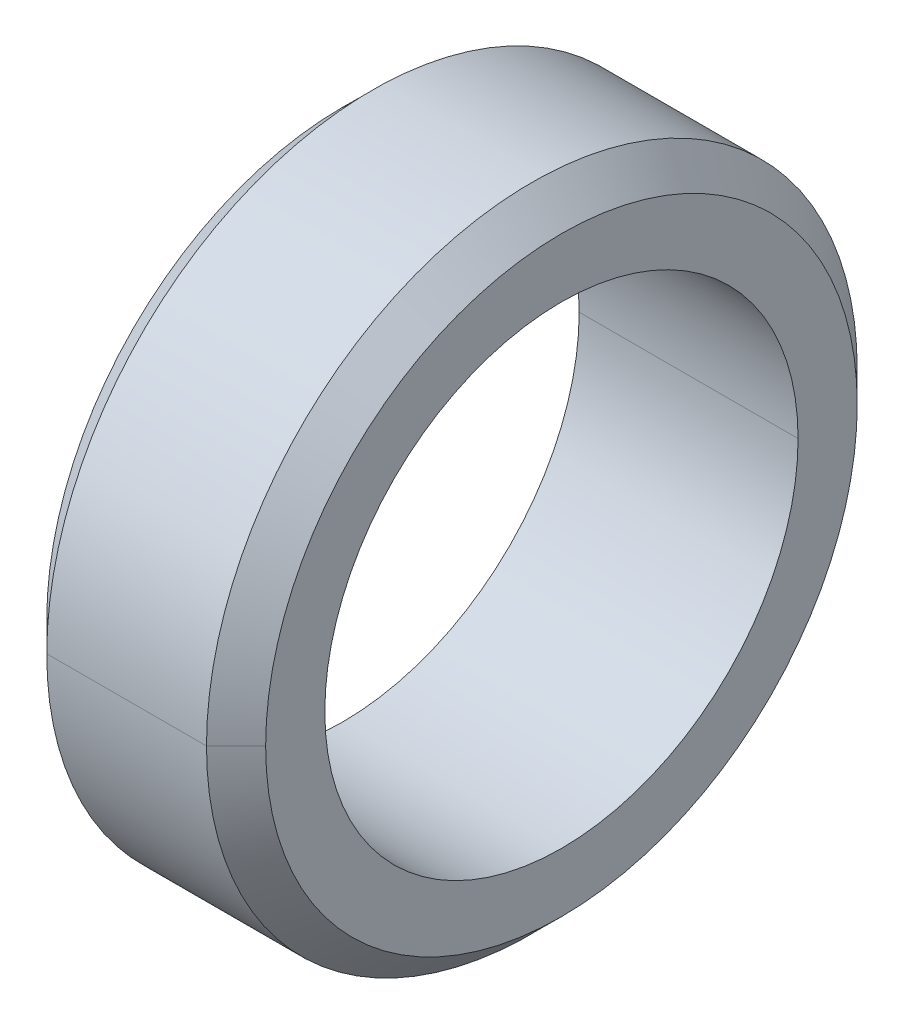
ISO-10303-21;
HEADER;
FILE_DESCRIPTION(('STEP AP214'),'2;1');
FILE_NAME('part.step','',(''),(''),'','','');
FILE_SCHEMA(('AUTOMOTIVE_DESIGN { 1 0 10303 214 1 1 1 1 }'));
ENDSEC;
DATA;
#1=APPLICATION_CONTEXT('core data for automotive mechanical design processes');
#2=APPLICATION_PROTOCOL_DEFINITION('international standard','automotive_design',2000,#1);
#3=PRODUCT_CONTEXT('',#1,'mechanical');
#4=PRODUCT('Part','Part','',(#3));
#5=PRODUCT_RELATED_PRODUCT_CATEGORY('part','',(#4));
#6=PRODUCT_DEFINITION_FORMATION('','',#4);
#7=PRODUCT_DEFINITION_CONTEXT('part definition',#1,'design');
#8=PRODUCT_DEFINITION('design','',#6,#7);
#9=PRODUCT_DEFINITION_SHAPE('','',#8);
#10=(LENGTH_UNIT() NAMED_UNIT(*) SI_UNIT(.MILLI.,.METRE.));
#11=(NAMED_UNIT(*) PLANE_ANGLE_UNIT() SI_UNIT($,.RADIAN.));
#12=(NAMED_UNIT(*) SI_UNIT($,.STERADIAN.) SOLID_ANGLE_UNIT());
#13=UNCERTAINTY_MEASURE_WITH_UNIT(LENGTH_MEASURE(1.E-05),#10,'distance_accuracy_value','');
#14=(GEOMETRIC_REPRESENTATION_CONTEXT(3) GLOBAL_UNCERTAINTY_ASSIGNED_CONTEXT((#13)) GLOBAL_UNIT_ASSIGNED_CONTEXT((#10,
#11,#12)) REPRESENTATION_CONTEXT('',''));
#15=CARTESIAN_POINT('',(0.,0.,0.));
#16=DIRECTION('',(0.,0.,1.));
#17=DIRECTION('',(1.,0.,0.));
#18=AXIS2_PLACEMENT_3D('',#15,#16,#17);
#19=CARTESIAN_POINT('',(0.,5.,0.));
#20=DIRECTION('',(-1.,0.,0.));
#21=DIRECTION('',(0.,0.,1.));
#22=AXIS2_PLACEMENT_3D('',#19,#20,#21);
#23=PLANE('',#22);
#24=CARTESIAN_POINT('',(0.,0.,0.));
#25=DIRECTION('',(1.,0.,0.));
#26=DIRECTION('',(0.,0.,-1.));
#27=AXIS2_PLACEMENT_3D('',#24,#25,#26);
#28=CIRCLE('',#27,4.);
#29=CARTESIAN_POINT('',(0.,0.,-4.));
#30=VERTEX_POINT('',#29);
#31=CARTESIAN_POINT('',(0.,0.,4.));
#32=VERTEX_POINT('',#31);
#33=EDGE_CURVE('E11',#30,#32,#28,.T.);
#34=ORIENTED_EDGE('',*,*,#33,.T.);
#35=CARTESIAN_POINT('',(0.,0.,0.));
#36=DIRECTION('',(1.,0.,0.));
#37=DIRECTION('',(0.,0.,-1.));
#38=AXIS2_PLACEMENT_3D('',#35,#36,#37);
#39=CIRCLE('',#38,4.);
#40=EDGE_CURVE('E26',#32,#30,#39,.T.);
#41=ORIENTED_EDGE('',*,*,#40,.T.);
#42=EDGE_LOOP('',(#34,#41));
#43=FACE_BOUND('',#42,.T.);
#44=CARTESIAN_POINT('',(0.,0.,0.));
#45=DIRECTION('',(1.,0.,0.));
#46=DIRECTION('',(0.,0.,-1.));
#47=AXIS2_PLACEMENT_3D('',#44,#45,#46);
#48=CIRCLE('',#47,5.);
#49=CARTESIAN_POINT('',(0.,0.,5.));
#50=VERTEX_POINT('',#49);
#51=CARTESIAN_POINT('',(0.,0.,-5.));
#52=VERTEX_POINT('',#51);
#53=EDGE_CURVE('E177',#50,#52,#48,.T.);
#54=ORIENTED_EDGE('',*,*,#53,.F.);
#55=CARTESIAN_POINT('',(0.,0.,0.));
#56=DIRECTION('',(1.,0.,0.));
#57=DIRECTION('',(0.,0.,-1.));
#58=AXIS2_PLACEMENT_3D('',#55,#56,#57);
#59=CIRCLE('',#58,5.);
#60=EDGE_CURVE('E171',#52,#50,#59,.T.);
#61=ORIENTED_EDGE('',*,*,#60,.F.);
#62=EDGE_LOOP('',(#54,#61));
#63=FACE_BOUND('',#62,.T.);
#64=ADVANCED_FACE('F17',(#43,#63),#23,.T.);
#65=CARTESIAN_POINT('',(0.5,0.,0.));
#66=DIRECTION('',(1.,0.,0.));
#67=DIRECTION('',(0.,-1.,0.));
#68=AXIS2_PLACEMENT_3D('',#65,#66,#67);
#69=CONICAL_SURFACE('',#68,5.5,0.785398163397448);
#70=DIRECTION('',(0.707106781186548,0.,0.707106781186547));
#71=VECTOR('',#70,1.);
#72=CARTESIAN_POINT('',(0.,0.,5.));
#73=LINE('',#72,#71);
#74=CARTESIAN_POINT('',(0.5,0.,5.5));
#75=VERTEX_POINT('',#74);
#76=EDGE_CURVE('E166',#50,#75,#73,.T.);
#77=ORIENTED_EDGE('',*,*,#76,.T.);
#78=CARTESIAN_POINT('',(0.5,0.,0.));
#79=DIRECTION('',(1.,0.,0.));
#80=DIRECTION('',(0.,0.,-1.));
#81=AXIS2_PLACEMENT_3D('',#78,#79,#80);
#82=CIRCLE('',#81,5.5);
#83=CARTESIAN_POINT('',(0.5,0.,-5.5));
#84=VERTEX_POINT('',#83);
#85=EDGE_CURVE('E160',#84,#75,#82,.T.);
#86=ORIENTED_EDGE('',*,*,#85,.F.);
#87=DIRECTION('',(0.707106781186548,0.,-0.707106781186547));
#88=VECTOR('',#87,1.);
#89=CARTESIAN_POINT('',(0.,0.,-5.));
#90=LINE('',#89,#88);
#91=EDGE_CURVE('E154',#52,#84,#90,.T.);
#92=ORIENTED_EDGE('',*,*,#91,.F.);
#93=ORIENTED_EDGE('',*,*,#60,.T.);
#94=EDGE_LOOP('',(#77,#86,#92,#93));
#95=FACE_BOUND('',#94,.T.);
#96=ADVANCED_FACE('F203',(#95),#69,.T.);
#97=CARTESIAN_POINT('',(0.5,0.,0.));
#98=DIRECTION('',(1.,0.,0.));
#99=DIRECTION('',(0.,1.,0.));
#100=AXIS2_PLACEMENT_3D('',#97,#98,#99);
#101=CONICAL_SURFACE('',#100,5.5,0.785398163397448);
#102=ORIENTED_EDGE('',*,*,#76,.F.);
#103=ORIENTED_EDGE('',*,*,#53,.T.);
#104=ORIENTED_EDGE('',*,*,#91,.T.);
#105=CARTESIAN_POINT('',(0.5,0.,0.));
#106=DIRECTION('',(1.,0.,0.));
#107=DIRECTION('',(0.,0.,-1.));
#108=AXIS2_PLACEMENT_3D('',#105,#106,#107);
#109=CIRCLE('',#108,5.5);
#110=EDGE_CURVE('E148',#75,#84,#109,.T.);
#111=ORIENTED_EDGE('',*,*,#110,.F.);
#112=EDGE_LOOP('',(#102,#103,#104,#111));
#113=FACE_BOUND('',#112,.T.);
#114=ADVANCED_FACE('F198',(#113),#101,.T.);
#115=CARTESIAN_POINT('',(3.7,0.,0.));
#116=DIRECTION('',(1.,0.,0.));
#117=DIRECTION('',(0.,1.,0.));
#118=AXIS2_PLACEMENT_3D('',#115,#116,#117);
#119=CYLINDRICAL_SURFACE('',#118,5.5);
#120=DIRECTION('',(1.,0.,0.));
#121=VECTOR('',#120,1.);
#122=CARTESIAN_POINT('',(0.5,0.,5.5));
#123=LINE('',#122,#121);
#124=CARTESIAN_POINT('',(3.2,0.,5.5));
#125=VERTEX_POINT('',#124);
#126=EDGE_CURVE('E142',#75,#125,#123,.T.);
#127=ORIENTED_EDGE('',*,*,#126,.F.);
#128=ORIENTED_EDGE('',*,*,#110,.T.);
#129=DIRECTION('',(1.,0.,0.));
#130=VECTOR('',#129,1.);
#131=CARTESIAN_POINT('',(0.5,0.,-5.5));
#132=LINE('',#131,#130);
#133=CARTESIAN_POINT('',(3.2,0.,-5.5));
#134=VERTEX_POINT('',#133);
#135=EDGE_CURVE('E137',#84,#134,#132,.T.);
#136=ORIENTED_EDGE('',*,*,#135,.T.);
#137=CARTESIAN_POINT('',(3.2,0.,0.));
#138=DIRECTION('',(1.,0.,0.));
#139=DIRECTION('',(0.,0.,-1.));
#140=AXIS2_PLACEMENT_3D('',#137,#138,#139);
#141=CIRCLE('',#140,5.5);
#142=EDGE_CURVE('E131',#125,#134,#141,.T.);
#143=ORIENTED_EDGE('',*,*,#142,.F.);
#144=EDGE_LOOP('',(#127,#128,#136,#143));
#145=FACE_BOUND('',#144,.T.);
#146=ADVANCED_FACE('F210',(#145),#119,.T.);
#147=CARTESIAN_POINT('',(3.7,0.,0.));
#148=DIRECTION('',(-1.,0.,0.));
#149=DIRECTION('',(0.,1.,0.));
#150=AXIS2_PLACEMENT_3D('',#147,#148,#149);
#151=CONICAL_SURFACE('',#150,5.,0.785398163397448);
#152=DIRECTION('',(-0.707106781186548,0.,-0.707106781186547));
#153=VECTOR('',#152,1.);
#154=CARTESIAN_POINT('',(3.7,0.,-5.));
#155=LINE('',#154,#153);
#156=CARTESIAN_POINT('',(3.7,0.,-5.));
#157=VERTEX_POINT('',#156);
#158=EDGE_CURVE('E125',#157,#134,#155,.T.);
#159=ORIENTED_EDGE('',*,*,#158,.F.);
#160=CARTESIAN_POINT('',(3.7,0.,0.));
#161=DIRECTION('',(1.,0.,0.));
#162=DIRECTION('',(0.,0.,-1.));
#163=AXIS2_PLACEMENT_3D('',#160,#161,#162);
#164=CIRCLE('',#163,5.);
#165=CARTESIAN_POINT('',(3.7,0.,5.));
#166=VERTEX_POINT('',#165);
#167=EDGE_CURVE('E119',#166,#157,#164,.T.);
#168=ORIENTED_EDGE('',*,*,#167,.F.);
#169=DIRECTION('',(-0.707106781186548,0.,0.707106781186547));
#170=VECTOR('',#169,1.);
#171=CARTESIAN_POINT('',(3.7,0.,5.));
#172=LINE('',#171,#170);
#173=EDGE_CURVE('E113',#166,#125,#172,.T.);
#174=ORIENTED_EDGE('',*,*,#173,.T.);
#175=ORIENTED_EDGE('',*,*,#142,.T.);
#176=EDGE_LOOP('',(#159,#168,#174,#175));
#177=FACE_BOUND('',#176,.T.);
#178=ADVANCED_FACE('F212',(#177),#151,.T.);
#179=CARTESIAN_POINT('',(3.7,0.,0.));
#180=DIRECTION('',(-1.,0.,0.));
#181=DIRECTION('',(0.,-1.,0.));
#182=AXIS2_PLACEMENT_3D('',#179,#180,#181);
#183=CONICAL_SURFACE('',#182,5.,0.785398163397448);
#184=ORIENTED_EDGE('',*,*,#158,.T.);
#185=CARTESIAN_POINT('',(3.2,0.,0.));
#186=DIRECTION('',(1.,0.,0.));
#187=DIRECTION('',(0.,0.,-1.));
#188=AXIS2_PLACEMENT_3D('',#185,#186,#187);
#189=CIRCLE('',#188,5.5);
#190=EDGE_CURVE('E102',#134,#125,#189,.T.);
#191=ORIENTED_EDGE('',*,*,#190,.T.);
#192=ORIENTED_EDGE('',*,*,#173,.F.);
#193=CARTESIAN_POINT('',(3.7,0.,0.));
#194=DIRECTION('',(1.,0.,0.));
#195=DIRECTION('',(0.,0.,-1.));
#196=AXIS2_PLACEMENT_3D('',#193,#194,#195);
#197=CIRCLE('',#196,5.);
#198=EDGE_CURVE('E96',#157,#166,#197,.T.);
#199=ORIENTED_EDGE('',*,*,#198,.F.);
#200=EDGE_LOOP('',(#184,#191,#192,#199));
#201=FACE_BOUND('',#200,.T.);
#202=ADVANCED_FACE('F216',(#201),#183,.T.);
#203=CARTESIAN_POINT('',(3.7,4.,0.));
#204=DIRECTION('',(1.,0.,0.));
#205=DIRECTION('',(0.,0.,-1.));
#206=AXIS2_PLACEMENT_3D('',#203,#204,#205);
#207=PLANE('',#206);
#208=ORIENTED_EDGE('',*,*,#198,.T.);
#209=ORIENTED_EDGE('',*,*,#167,.T.);
#210=EDGE_LOOP('',(#208,#209));
#211=FACE_BOUND('',#210,.T.);
#212=CARTESIAN_POINT('',(3.7,0.,0.));
#213=DIRECTION('',(1.,0.,0.));
#214=DIRECTION('',(0.,0.,-1.));
#215=AXIS2_PLACEMENT_3D('',#212,#213,#214);
#216=CIRCLE('',#215,4.);
#217=CARTESIAN_POINT('',(3.7,0.,4.));
#218=VERTEX_POINT('',#217);
#219=CARTESIAN_POINT('',(3.7,0.,-4.));
#220=VERTEX_POINT('',#219);
#221=EDGE_CURVE('E81',#218,#220,#216,.T.);
#222=ORIENTED_EDGE('',*,*,#221,.F.);
#223=CARTESIAN_POINT('',(3.7,0.,0.));
#224=DIRECTION('',(1.,0.,0.));
#225=DIRECTION('',(0.,0.,-1.));
#226=AXIS2_PLACEMENT_3D('',#223,#224,#225);
#227=CIRCLE('',#226,4.);
#228=EDGE_CURVE('E77',#220,#218,#227,.T.);
#229=ORIENTED_EDGE('',*,*,#228,.F.);
#230=EDGE_LOOP('',(#222,#229));
#231=FACE_BOUND('',#230,.T.);
#232=ADVANCED_FACE('F79',(#211,#231),#207,.T.);
#233=CARTESIAN_POINT('',(3.7,0.,0.));
#234=DIRECTION('',(1.,0.,0.));
#235=DIRECTION('',(0.,-1.,0.));
#236=AXIS2_PLACEMENT_3D('',#233,#234,#235);
#237=CYLINDRICAL_SURFACE('',#236,4.);
#238=DIRECTION('',(1.,0.,0.));
#239=VECTOR('',#238,1.);
#240=CARTESIAN_POINT('',(0.,0.,4.));
#241=LINE('',#240,#239);
#242=EDGE_CURVE('E86',#32,#218,#241,.T.);
#243=ORIENTED_EDGE('',*,*,#242,.F.);
#244=ORIENTED_EDGE('',*,*,#33,.F.);
#245=DIRECTION('',(1.,0.,0.));
#246=VECTOR('',#245,1.);
#247=CARTESIAN_POINT('',(0.,0.,-4.));
#248=LINE('',#247,#246);
#249=EDGE_CURVE('E89',#30,#220,#248,.T.);
#250=ORIENTED_EDGE('',*,*,#249,.T.);
#251=ORIENTED_EDGE('',*,*,#228,.T.);
#252=EDGE_LOOP('',(#243,#244,#250,#251));
#253=FACE_BOUND('',#252,.T.);
#254=ADVANCED_FACE('F90',(#253),#237,.F.);
#255=CARTESIAN_POINT('',(3.7,0.,0.));
#256=DIRECTION('',(1.,0.,0.));
#257=DIRECTION('',(0.,1.,0.));
#258=AXIS2_PLACEMENT_3D('',#255,#256,#257);
#259=CYLINDRICAL_SURFACE('',#258,4.);
#260=ORIENTED_EDGE('',*,*,#242,.T.);
#261=ORIENTED_EDGE('',*,*,#221,.T.);
#262=ORIENTED_EDGE('',*,*,#249,.F.);
#263=ORIENTED_EDGE('',*,*,#40,.F.);
#264=EDGE_LOOP('',(#260,#261,#262,#263));
#265=FACE_BOUND('',#264,.T.);
#266=ADVANCED_FACE('F94',(#265),#259,.F.);
#267=CARTESIAN_POINT('',(3.7,0.,0.));
#268=DIRECTION('',(1.,0.,0.));
#269=DIRECTION('',(0.,-1.,-1.04482928035209E-10));
#270=AXIS2_PLACEMENT_3D('',#267,#268,#269);
#271=CYLINDRICAL_SURFACE('',#270,5.5);
#272=ORIENTED_EDGE('',*,*,#126,.T.);
#273=ORIENTED_EDGE('',*,*,#190,.F.);
#274=ORIENTED_EDGE('',*,*,#135,.F.);
#275=ORIENTED_EDGE('',*,*,#85,.T.);
#276=EDGE_LOOP('',(#272,#273,#274,#275));
#277=FACE_BOUND('',#276,.T.);
#278=ADVANCED_FACE('F206',(#277),#271,.T.);
#279=CLOSED_SHELL('',(#64,#96,#114,#146,#178,#202,#232,#254,#266,#278));
#280=MANIFOLD_SOLID_BREP('B1',#279);
#281=ADVANCED_BREP_SHAPE_REPRESENTATION('',(#18,#280),#14);
#282=SHAPE_DEFINITION_REPRESENTATION(#9,#281);
ENDSEC;
END-ISO-10303-21;
